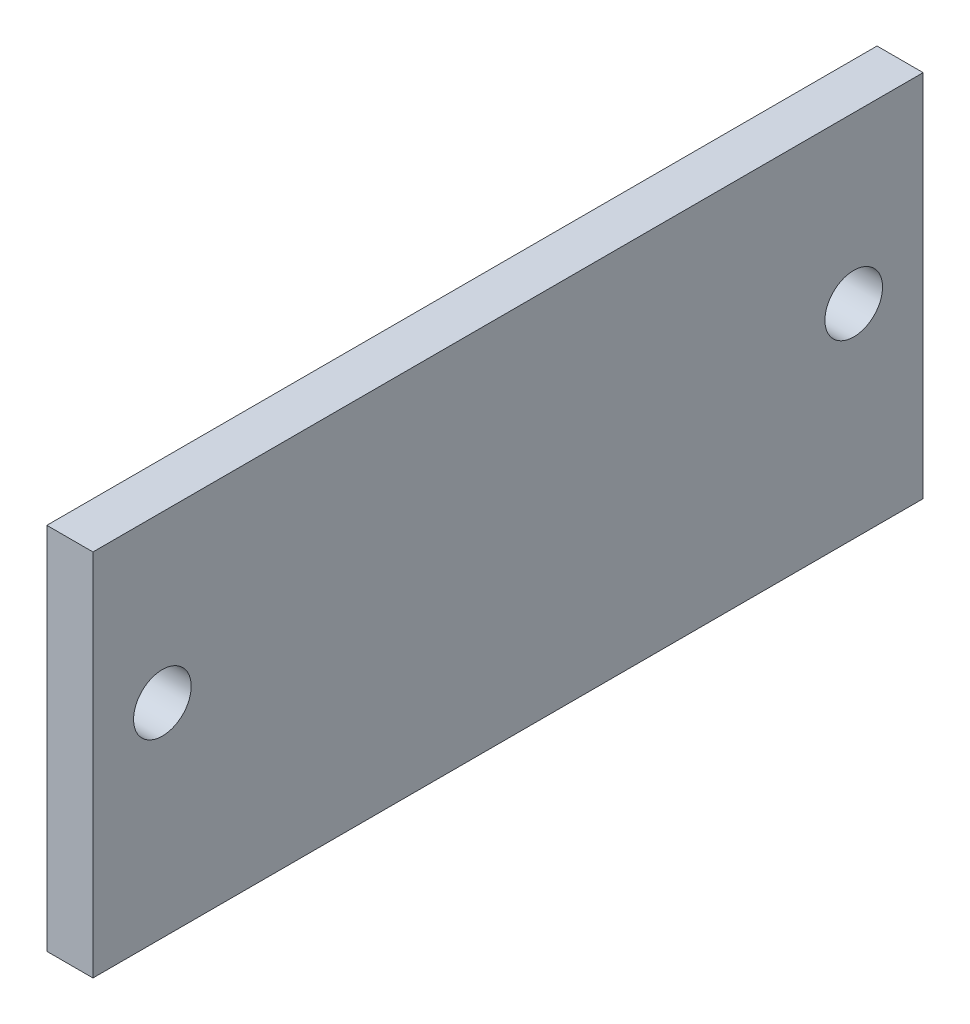
ISO-10303-21;
HEADER;
FILE_DESCRIPTION(('STEP AP214'),'2;1');
FILE_NAME('part.step','',(''),(''),'','','');
FILE_SCHEMA(('AUTOMOTIVE_DESIGN { 1 0 10303 214 1 1 1 1 }'));
ENDSEC;
DATA;
#1=APPLICATION_CONTEXT('core data for automotive mechanical design processes');
#2=APPLICATION_PROTOCOL_DEFINITION('international standard','automotive_design',2000,#1);
#3=PRODUCT_CONTEXT('',#1,'mechanical');
#4=PRODUCT('Part','Part','',(#3));
#5=PRODUCT_RELATED_PRODUCT_CATEGORY('part','',(#4));
#6=PRODUCT_DEFINITION_FORMATION('','',#4);
#7=PRODUCT_DEFINITION_CONTEXT('part definition',#1,'design');
#8=PRODUCT_DEFINITION('design','',#6,#7);
#9=PRODUCT_DEFINITION_SHAPE('','',#8);
#10=(LENGTH_UNIT() NAMED_UNIT(*) SI_UNIT(.MILLI.,.METRE.));
#11=(NAMED_UNIT(*) PLANE_ANGLE_UNIT() SI_UNIT($,.RADIAN.));
#12=(NAMED_UNIT(*) SI_UNIT($,.STERADIAN.) SOLID_ANGLE_UNIT());
#13=UNCERTAINTY_MEASURE_WITH_UNIT(LENGTH_MEASURE(1.E-05),#10,'distance_accuracy_value','');
#14=(GEOMETRIC_REPRESENTATION_CONTEXT(3) GLOBAL_UNCERTAINTY_ASSIGNED_CONTEXT((#13)) GLOBAL_UNIT_ASSIGNED_CONTEXT((#10,
#11,#12)) REPRESENTATION_CONTEXT('',''));
#15=CARTESIAN_POINT('',(0.,0.,0.));
#16=DIRECTION('',(0.,0.,1.));
#17=DIRECTION('',(1.,0.,0.));
#18=AXIS2_PLACEMENT_3D('',#15,#16,#17);
#19=CARTESIAN_POINT('',(-12.7,50.8,114.3));
#20=DIRECTION('',(0.,0.,1.));
#21=DIRECTION('',(1.,0.,0.));
#22=AXIS2_PLACEMENT_3D('',#19,#20,#21);
#23=PLANE('',#22);
#24=DIRECTION('',(0.,-1.,0.));
#25=VECTOR('',#24,1.);
#26=CARTESIAN_POINT('',(0.,50.8,114.3));
#27=LINE('',#26,#25);
#28=CARTESIAN_POINT('',(0.,50.8,114.3));
#29=VERTEX_POINT('',#28);
#30=CARTESIAN_POINT('',(0.,-50.8,114.3));
#31=VERTEX_POINT('',#30);
#32=EDGE_CURVE('E98',#29,#31,#27,.T.);
#33=ORIENTED_EDGE('',*,*,#32,.F.);
#34=DIRECTION('',(1.,0.,0.));
#35=VECTOR('',#34,1.);
#36=CARTESIAN_POINT('',(-12.7,50.8,114.3));
#37=LINE('',#36,#35);
#38=CARTESIAN_POINT('',(-12.7,50.8,114.3));
#39=VERTEX_POINT('',#38);
#40=EDGE_CURVE('E11',#39,#29,#37,.T.);
#41=ORIENTED_EDGE('',*,*,#40,.F.);
#42=DIRECTION('',(0.,-1.,0.));
#43=VECTOR('',#42,1.);
#44=CARTESIAN_POINT('',(-12.7,50.8,114.3));
#45=LINE('',#44,#43);
#46=CARTESIAN_POINT('',(-12.7,-50.8,114.3));
#47=VERTEX_POINT('',#46);
#48=EDGE_CURVE('E91',#39,#47,#45,.T.);
#49=ORIENTED_EDGE('',*,*,#48,.T.);
#50=DIRECTION('',(1.,0.,0.));
#51=VECTOR('',#50,1.);
#52=CARTESIAN_POINT('',(-12.7,-50.8,114.3));
#53=LINE('',#52,#51);
#54=EDGE_CURVE('E36',#47,#31,#53,.T.);
#55=ORIENTED_EDGE('',*,*,#54,.T.);
#56=EDGE_LOOP('',(#33,#41,#49,#55));
#57=FACE_BOUND('',#56,.T.);
#58=ADVANCED_FACE('F33',(#57),#23,.T.);
#59=CARTESIAN_POINT('',(-12.7,50.8,-114.3));
#60=DIRECTION('',(0.,1.,0.));
#61=DIRECTION('',(0.,0.,1.));
#62=AXIS2_PLACEMENT_3D('',#59,#60,#61);
#63=PLANE('',#62);
#64=DIRECTION('',(0.,0.,1.));
#65=VECTOR('',#64,1.);
#66=CARTESIAN_POINT('',(0.,50.8,-114.3));
#67=LINE('',#66,#65);
#68=CARTESIAN_POINT('',(0.,50.8,-114.3));
#69=VERTEX_POINT('',#68);
#70=EDGE_CURVE('E93',#69,#29,#67,.T.);
#71=ORIENTED_EDGE('',*,*,#70,.F.);
#72=DIRECTION('',(1.,0.,0.));
#73=VECTOR('',#72,1.);
#74=CARTESIAN_POINT('',(-12.7,50.8,-114.3));
#75=LINE('',#74,#73);
#76=CARTESIAN_POINT('',(-12.7,50.8,-114.3));
#77=VERTEX_POINT('',#76);
#78=EDGE_CURVE('E42',#77,#69,#75,.T.);
#79=ORIENTED_EDGE('',*,*,#78,.F.);
#80=DIRECTION('',(0.,0.,1.));
#81=VECTOR('',#80,1.);
#82=CARTESIAN_POINT('',(-12.7,50.8,-114.3));
#83=LINE('',#82,#81);
#84=EDGE_CURVE('E88',#77,#39,#83,.T.);
#85=ORIENTED_EDGE('',*,*,#84,.T.);
#86=ORIENTED_EDGE('',*,*,#40,.T.);
#87=EDGE_LOOP('',(#71,#79,#85,#86));
#88=FACE_BOUND('',#87,.T.);
#89=ADVANCED_FACE('F109',(#88),#63,.T.);
#90=CARTESIAN_POINT('',(-12.7,50.8,-114.3));
#91=DIRECTION('',(0.,0.,-1.));
#92=DIRECTION('',(-1.,0.,0.));
#93=AXIS2_PLACEMENT_3D('',#90,#91,#92);
#94=PLANE('',#93);
#95=DIRECTION('',(0.,1.,0.));
#96=VECTOR('',#95,1.);
#97=CARTESIAN_POINT('',(0.,50.8,-114.3));
#98=LINE('',#97,#96);
#99=CARTESIAN_POINT('',(0.,-50.8,-114.3));
#100=VERTEX_POINT('',#99);
#101=EDGE_CURVE('E83',#100,#69,#98,.T.);
#102=ORIENTED_EDGE('',*,*,#101,.F.);
#103=DIRECTION('',(1.,0.,0.));
#104=VECTOR('',#103,1.);
#105=CARTESIAN_POINT('',(-12.7,-50.8,-114.3));
#106=LINE('',#105,#104);
#107=CARTESIAN_POINT('',(-12.7,-50.8,-114.3));
#108=VERTEX_POINT('',#107);
#109=EDGE_CURVE('E78',#108,#100,#106,.T.);
#110=ORIENTED_EDGE('',*,*,#109,.F.);
#111=DIRECTION('',(0.,1.,0.));
#112=VECTOR('',#111,1.);
#113=CARTESIAN_POINT('',(-12.7,50.8,-114.3));
#114=LINE('',#113,#112);
#115=EDGE_CURVE('E81',#108,#77,#114,.T.);
#116=ORIENTED_EDGE('',*,*,#115,.T.);
#117=ORIENTED_EDGE('',*,*,#78,.T.);
#118=EDGE_LOOP('',(#102,#110,#116,#117));
#119=FACE_BOUND('',#118,.T.);
#120=ADVANCED_FACE('F80',(#119),#94,.T.);
#121=CARTESIAN_POINT('',(-12.7,-50.8,-114.3));
#122=DIRECTION('',(0.,-1.,0.));
#123=DIRECTION('',(0.,0.,-1.));
#124=AXIS2_PLACEMENT_3D('',#121,#122,#123);
#125=PLANE('',#124);
#126=DIRECTION('',(0.,0.,-1.));
#127=VECTOR('',#126,1.);
#128=CARTESIAN_POINT('',(0.,-50.8,-114.3));
#129=LINE('',#128,#127);
#130=EDGE_CURVE('E101',#31,#100,#129,.T.);
#131=ORIENTED_EDGE('',*,*,#130,.F.);
#132=ORIENTED_EDGE('',*,*,#54,.F.);
#133=DIRECTION('',(0.,0.,-1.));
#134=VECTOR('',#133,1.);
#135=CARTESIAN_POINT('',(-12.7,-50.8,-114.3));
#136=LINE('',#135,#134);
#137=EDGE_CURVE('E87',#47,#108,#136,.T.);
#138=ORIENTED_EDGE('',*,*,#137,.T.);
#139=ORIENTED_EDGE('',*,*,#109,.T.);
#140=EDGE_LOOP('',(#131,#132,#138,#139));
#141=FACE_BOUND('',#140,.T.);
#142=ADVANCED_FACE('F90',(#141),#125,.T.);
#143=CARTESIAN_POINT('',(-12.7,0.,0.));
#144=DIRECTION('',(-1.,0.,0.));
#145=DIRECTION('',(0.,0.,1.));
#146=AXIS2_PLACEMENT_3D('',#143,#144,#145);
#147=PLANE('',#146);
#148=CARTESIAN_POINT('',(-12.7,5.27049999999999,-95.1865));
#149=DIRECTION('',(-1.,0.,0.));
#150=DIRECTION('',(0.,0.,1.));
#151=AXIS2_PLACEMENT_3D('',#148,#149,#150);
#152=CIRCLE('',#151,7.93749999999999);
#153=CARTESIAN_POINT('',(-12.7,5.27049999999999,-87.249));
#154=VERTEX_POINT('',#153);
#155=EDGE_CURVE('E143',#154,#154,#152,.T.);
#156=ORIENTED_EDGE('',*,*,#155,.F.);
#157=EDGE_LOOP('',(#156));
#158=FACE_BOUND('',#157,.T.);
#159=CARTESIAN_POINT('',(-12.7,5.27049999999999,95.1865));
#160=DIRECTION('',(-1.,0.,0.));
#161=DIRECTION('',(0.,0.,1.));
#162=AXIS2_PLACEMENT_3D('',#159,#160,#161);
#163=CIRCLE('',#162,7.93749999999999);
#164=CARTESIAN_POINT('',(-12.7,5.27049999999999,103.124));
#165=VERTEX_POINT('',#164);
#166=EDGE_CURVE('E148',#165,#165,#163,.F.);
#167=ORIENTED_EDGE('',*,*,#166,.T.);
#168=EDGE_LOOP('',(#167));
#169=FACE_BOUND('',#168,.T.);
#170=ORIENTED_EDGE('',*,*,#48,.F.);
#171=ORIENTED_EDGE('',*,*,#84,.F.);
#172=ORIENTED_EDGE('',*,*,#115,.F.);
#173=ORIENTED_EDGE('',*,*,#137,.F.);
#174=EDGE_LOOP('',(#170,#171,#172,#173));
#175=FACE_BOUND('',#174,.T.);
#176=ADVANCED_FACE('F86',(#158,#169,#175),#147,.T.);
#177=CARTESIAN_POINT('',(0.,0.,0.));
#178=DIRECTION('',(-1.,0.,0.));
#179=DIRECTION('',(0.,0.,1.));
#180=AXIS2_PLACEMENT_3D('',#177,#178,#179);
#181=PLANE('',#180);
#182=CARTESIAN_POINT('',(0.,5.27049999999999,-95.1865));
#183=DIRECTION('',(-1.,0.,0.));
#184=DIRECTION('',(0.,0.,1.));
#185=AXIS2_PLACEMENT_3D('',#182,#183,#184);
#186=CIRCLE('',#185,7.93749999999999);
#187=CARTESIAN_POINT('',(0.,5.27049999999999,-87.249));
#188=VERTEX_POINT('',#187);
#189=EDGE_CURVE('E146',#188,#188,#186,.T.);
#190=ORIENTED_EDGE('',*,*,#189,.T.);
#191=EDGE_LOOP('',(#190));
#192=FACE_BOUND('',#191,.T.);
#193=CARTESIAN_POINT('',(0.,5.27049999999999,95.1865));
#194=DIRECTION('',(1.,0.,0.));
#195=DIRECTION('',(0.,0.,-1.));
#196=AXIS2_PLACEMENT_3D('',#193,#194,#195);
#197=CIRCLE('',#196,7.93749999999999);
#198=CARTESIAN_POINT('',(0.,5.27049999999999,87.249));
#199=VERTEX_POINT('',#198);
#200=EDGE_CURVE('E102',#199,#199,#197,.T.);
#201=ORIENTED_EDGE('',*,*,#200,.F.);
#202=EDGE_LOOP('',(#201));
#203=FACE_BOUND('',#202,.T.);
#204=ORIENTED_EDGE('',*,*,#32,.T.);
#205=ORIENTED_EDGE('',*,*,#130,.T.);
#206=ORIENTED_EDGE('',*,*,#101,.T.);
#207=ORIENTED_EDGE('',*,*,#70,.T.);
#208=EDGE_LOOP('',(#204,#205,#206,#207));
#209=FACE_BOUND('',#208,.T.);
#210=ADVANCED_FACE('F108',(#192,#203,#209),#181,.F.);
#211=CARTESIAN_POINT('',(-12.701,5.27049999999999,95.1865));
#212=DIRECTION('',(1.,0.,0.));
#213=DIRECTION('',(0.,0.,-1.));
#214=AXIS2_PLACEMENT_3D('',#211,#212,#213);
#215=CYLINDRICAL_SURFACE('',#214,7.93749999999999);
#216=ORIENTED_EDGE('',*,*,#166,.F.);
#217=EDGE_LOOP('',(#216));
#218=FACE_BOUND('',#217,.T.);
#219=ORIENTED_EDGE('',*,*,#200,.T.);
#220=EDGE_LOOP('',(#219));
#221=FACE_BOUND('',#220,.T.);
#222=ADVANCED_FACE('F128',(#218,#221),#215,.F.);
#223=CARTESIAN_POINT('',(-12.701,5.27049999999999,-95.1865));
#224=DIRECTION('',(1.,0.,0.));
#225=DIRECTION('',(0.,0.,-1.));
#226=AXIS2_PLACEMENT_3D('',#223,#224,#225);
#227=CYLINDRICAL_SURFACE('',#226,7.93749999999999);
#228=ORIENTED_EDGE('',*,*,#155,.T.);
#229=EDGE_LOOP('',(#228));
#230=FACE_BOUND('',#229,.T.);
#231=ORIENTED_EDGE('',*,*,#189,.F.);
#232=EDGE_LOOP('',(#231));
#233=FACE_BOUND('',#232,.T.);
#234=ADVANCED_FACE('F135',(#230,#233),#227,.F.);
#235=CLOSED_SHELL('',(#58,#89,#120,#142,#176,#210,#222,#234));
#236=MANIFOLD_SOLID_BREP('B2',#235);
#237=ADVANCED_BREP_SHAPE_REPRESENTATION('',(#18,#236),#14);
#238=SHAPE_DEFINITION_REPRESENTATION(#9,#237);
ENDSEC;
END-ISO-10303-21;
